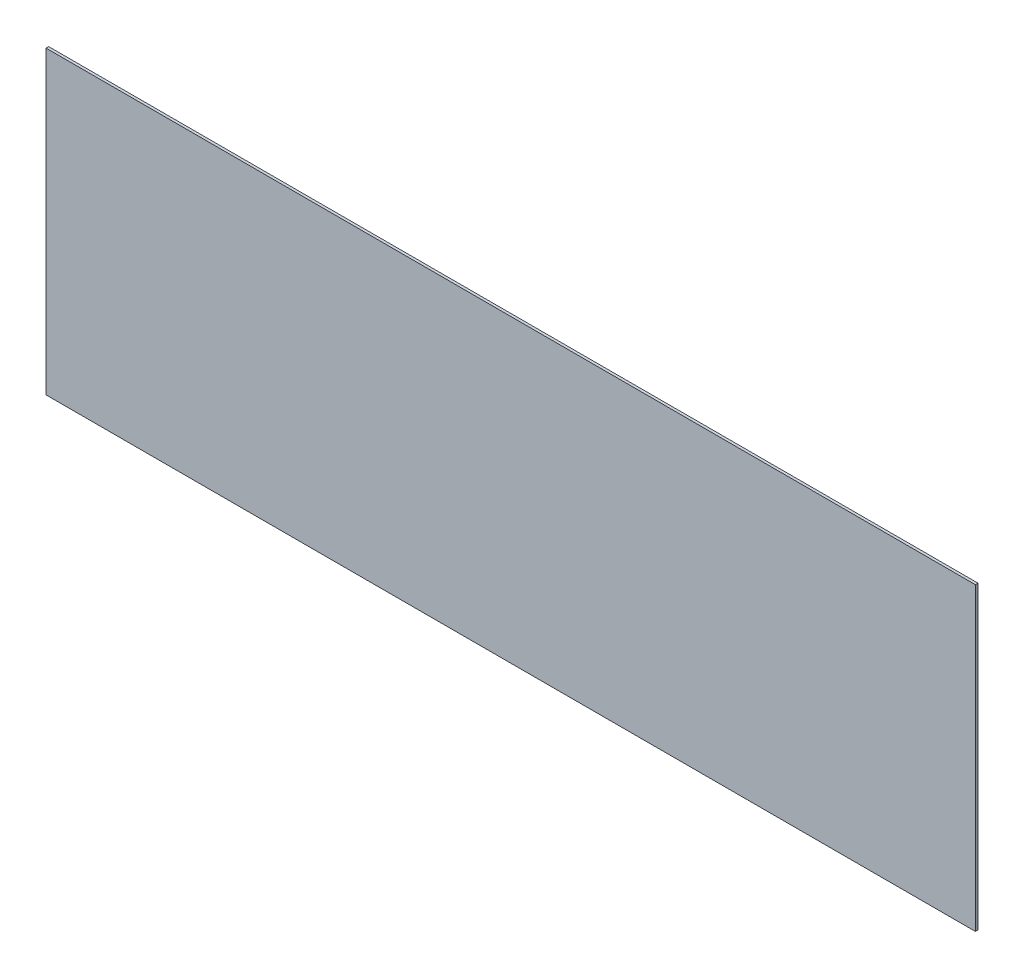
ISO-10303-21;
HEADER;
FILE_DESCRIPTION(('STEP AP214'),'2;1');
FILE_NAME('part.step','',(''),(''),'','','');
FILE_SCHEMA(('AUTOMOTIVE_DESIGN { 1 0 10303 214 1 1 1 1 }'));
ENDSEC;
DATA;
#1=APPLICATION_CONTEXT('core data for automotive mechanical design processes');
#2=APPLICATION_PROTOCOL_DEFINITION('international standard','automotive_design',2000,#1);
#3=PRODUCT_CONTEXT('',#1,'mechanical');
#4=PRODUCT('Part','Part','',(#3));
#5=PRODUCT_RELATED_PRODUCT_CATEGORY('part','',(#4));
#6=PRODUCT_DEFINITION_FORMATION('','',#4);
#7=PRODUCT_DEFINITION_CONTEXT('part definition',#1,'design');
#8=PRODUCT_DEFINITION('design','',#6,#7);
#9=PRODUCT_DEFINITION_SHAPE('','',#8);
#10=(LENGTH_UNIT() NAMED_UNIT(*) SI_UNIT(.MILLI.,.METRE.));
#11=(NAMED_UNIT(*) PLANE_ANGLE_UNIT() SI_UNIT($,.RADIAN.));
#12=(NAMED_UNIT(*) SI_UNIT($,.STERADIAN.) SOLID_ANGLE_UNIT());
#13=UNCERTAINTY_MEASURE_WITH_UNIT(LENGTH_MEASURE(1.E-05),#10,'distance_accuracy_value','');
#14=(GEOMETRIC_REPRESENTATION_CONTEXT(3) GLOBAL_UNCERTAINTY_ASSIGNED_CONTEXT((#13)) GLOBAL_UNIT_ASSIGNED_CONTEXT((#10,
#11,#12)) REPRESENTATION_CONTEXT('',''));
#15=CARTESIAN_POINT('',(0.,0.,0.));
#16=DIRECTION('',(0.,0.,1.));
#17=DIRECTION('',(1.,0.,0.));
#18=AXIS2_PLACEMENT_3D('',#15,#16,#17);
#19=CARTESIAN_POINT('',(61.722,-172.815354699861,0.126999999999988));
#20=DIRECTION('',(-1.,0.,0.));
#21=DIRECTION('',(0.,0.,1.));
#22=AXIS2_PLACEMENT_3D('',#19,#20,#21);
#23=PLANE('',#22);
#24=DIRECTION('',(0.,1.,0.));
#25=VECTOR('',#24,1.);
#26=CARTESIAN_POINT('',(61.722,-172.815354699861,0.));
#27=LINE('',#26,#25);
#28=CARTESIAN_POINT('',(61.722,-172.815354699861,0.));
#29=VERTEX_POINT('',#28);
#30=CARTESIAN_POINT('',(61.722,-158.369104699861,0.));
#31=VERTEX_POINT('',#30);
#32=EDGE_CURVE('E95',#29,#31,#27,.T.);
#33=ORIENTED_EDGE('',*,*,#32,.T.);
#34=DIRECTION('',(0.,0.,-1.));
#35=VECTOR('',#34,1.);
#36=CARTESIAN_POINT('',(61.722,-158.369104699861,0.126999999999988));
#37=LINE('',#36,#35);
#38=CARTESIAN_POINT('',(61.722,-158.369104699861,0.126999999999988));
#39=VERTEX_POINT('',#38);
#40=EDGE_CURVE('E11',#39,#31,#37,.T.);
#41=ORIENTED_EDGE('',*,*,#40,.F.);
#42=DIRECTION('',(0.,1.,0.));
#43=VECTOR('',#42,1.);
#44=CARTESIAN_POINT('',(61.722,-172.815354699861,0.126999999999988));
#45=LINE('',#44,#43);
#46=CARTESIAN_POINT('',(61.722,-172.815354699861,0.126999999999988));
#47=VERTEX_POINT('',#46);
#48=EDGE_CURVE('E83',#47,#39,#45,.T.);
#49=ORIENTED_EDGE('',*,*,#48,.F.);
#50=DIRECTION('',(0.,0.,-1.));
#51=VECTOR('',#50,1.);
#52=CARTESIAN_POINT('',(61.722,-172.815354699861,0.126999999999988));
#53=LINE('',#52,#51);
#54=EDGE_CURVE('E91',#47,#29,#53,.T.);
#55=ORIENTED_EDGE('',*,*,#54,.T.);
#56=EDGE_LOOP('',(#33,#41,#49,#55));
#57=FACE_BOUND('',#56,.T.);
#58=ADVANCED_FACE('F32',(#57),#23,.F.);
#59=CARTESIAN_POINT('',(61.722,-158.369104699861,0.126999999999988));
#60=DIRECTION('',(0.,-1.,0.));
#61=DIRECTION('',(0.,0.,-1.));
#62=AXIS2_PLACEMENT_3D('',#59,#60,#61);
#63=PLANE('',#62);
#64=DIRECTION('',(-1.,0.,0.));
#65=VECTOR('',#64,1.);
#66=CARTESIAN_POINT('',(61.722,-158.369104699861,0.));
#67=LINE('',#66,#65);
#68=CARTESIAN_POINT('',(17.018,-158.369104699861,0.));
#69=VERTEX_POINT('',#68);
#70=EDGE_CURVE('E87',#31,#69,#67,.T.);
#71=ORIENTED_EDGE('',*,*,#70,.T.);
#72=DIRECTION('',(0.,0.,-1.));
#73=VECTOR('',#72,1.);
#74=CARTESIAN_POINT('',(17.018,-158.369104699861,0.126999999999988));
#75=LINE('',#74,#73);
#76=CARTESIAN_POINT('',(17.018,-158.369104699861,0.126999999999988));
#77=VERTEX_POINT('',#76);
#78=EDGE_CURVE('E40',#77,#69,#75,.T.);
#79=ORIENTED_EDGE('',*,*,#78,.F.);
#80=DIRECTION('',(-1.,0.,0.));
#81=VECTOR('',#80,1.);
#82=CARTESIAN_POINT('',(61.722,-158.369104699861,0.126999999999988));
#83=LINE('',#82,#81);
#84=EDGE_CURVE('E78',#39,#77,#83,.T.);
#85=ORIENTED_EDGE('',*,*,#84,.F.);
#86=ORIENTED_EDGE('',*,*,#40,.T.);
#87=EDGE_LOOP('',(#71,#79,#85,#86));
#88=FACE_BOUND('',#87,.T.);
#89=ADVANCED_FACE('F86',(#88),#63,.F.);
#90=CARTESIAN_POINT('',(17.018,-172.815354699861,0.126999999999988));
#91=DIRECTION('',(1.,0.,0.));
#92=DIRECTION('',(0.,0.,-1.));
#93=AXIS2_PLACEMENT_3D('',#90,#91,#92);
#94=PLANE('',#93);
#95=DIRECTION('',(0.,-1.,0.));
#96=VECTOR('',#95,1.);
#97=CARTESIAN_POINT('',(17.018,-172.815354699861,0.));
#98=LINE('',#97,#96);
#99=CARTESIAN_POINT('',(17.018,-172.815354699861,0.));
#100=VERTEX_POINT('',#99);
#101=EDGE_CURVE('E65',#69,#100,#98,.T.);
#102=ORIENTED_EDGE('',*,*,#101,.T.);
#103=DIRECTION('',(0.,0.,-1.));
#104=VECTOR('',#103,1.);
#105=CARTESIAN_POINT('',(17.018,-172.815354699861,0.126999999999988));
#106=LINE('',#105,#104);
#107=CARTESIAN_POINT('',(17.018,-172.815354699861,0.126999999999988));
#108=VERTEX_POINT('',#107);
#109=EDGE_CURVE('E88',#108,#100,#106,.T.);
#110=ORIENTED_EDGE('',*,*,#109,.F.);
#111=DIRECTION('',(0.,-1.,0.));
#112=VECTOR('',#111,1.);
#113=CARTESIAN_POINT('',(17.018,-172.815354699861,0.126999999999988));
#114=LINE('',#113,#112);
#115=EDGE_CURVE('E81',#77,#108,#114,.T.);
#116=ORIENTED_EDGE('',*,*,#115,.F.);
#117=ORIENTED_EDGE('',*,*,#78,.T.);
#118=EDGE_LOOP('',(#102,#110,#116,#117));
#119=FACE_BOUND('',#118,.T.);
#120=ADVANCED_FACE('F89',(#119),#94,.F.);
#121=CARTESIAN_POINT('',(61.722,-172.815354699861,0.126999999999988));
#122=DIRECTION('',(0.,1.,0.));
#123=DIRECTION('',(0.,0.,1.));
#124=AXIS2_PLACEMENT_3D('',#121,#122,#123);
#125=PLANE('',#124);
#126=DIRECTION('',(1.,0.,0.));
#127=VECTOR('',#126,1.);
#128=CARTESIAN_POINT('',(61.722,-172.815354699861,0.));
#129=LINE('',#128,#127);
#130=EDGE_CURVE('E71',#100,#29,#129,.T.);
#131=ORIENTED_EDGE('',*,*,#130,.T.);
#132=ORIENTED_EDGE('',*,*,#54,.F.);
#133=DIRECTION('',(1.,0.,0.));
#134=VECTOR('',#133,1.);
#135=CARTESIAN_POINT('',(61.722,-172.815354699861,0.126999999999988));
#136=LINE('',#135,#134);
#137=EDGE_CURVE('E48',#108,#47,#136,.T.);
#138=ORIENTED_EDGE('',*,*,#137,.F.);
#139=ORIENTED_EDGE('',*,*,#109,.T.);
#140=EDGE_LOOP('',(#131,#132,#138,#139));
#141=FACE_BOUND('',#140,.T.);
#142=ADVANCED_FACE('F102',(#141),#125,.F.);
#143=CARTESIAN_POINT('',(0.,0.,0.126999999999988));
#144=DIRECTION('',(0.,0.,1.));
#145=DIRECTION('',(1.,0.,0.));
#146=AXIS2_PLACEMENT_3D('',#143,#144,#145);
#147=PLANE('',#146);
#148=ORIENTED_EDGE('',*,*,#48,.T.);
#149=ORIENTED_EDGE('',*,*,#84,.T.);
#150=ORIENTED_EDGE('',*,*,#115,.T.);
#151=ORIENTED_EDGE('',*,*,#137,.T.);
#152=EDGE_LOOP('',(#148,#149,#150,#151));
#153=FACE_BOUND('',#152,.T.);
#154=ADVANCED_FACE('F79',(#153),#147,.T.);
#155=CARTESIAN_POINT('',(0.,0.,0.));
#156=DIRECTION('',(0.,0.,1.));
#157=DIRECTION('',(1.,0.,0.));
#158=AXIS2_PLACEMENT_3D('',#155,#156,#157);
#159=PLANE('',#158);
#160=ORIENTED_EDGE('',*,*,#32,.F.);
#161=ORIENTED_EDGE('',*,*,#130,.F.);
#162=ORIENTED_EDGE('',*,*,#101,.F.);
#163=ORIENTED_EDGE('',*,*,#70,.F.);
#164=EDGE_LOOP('',(#160,#161,#162,#163));
#165=FACE_BOUND('',#164,.T.);
#166=ADVANCED_FACE('F105',(#165),#159,.F.);
#167=CLOSED_SHELL('',(#58,#89,#120,#142,#154,#166));
#168=MANIFOLD_SOLID_BREP('B2',#167);
#169=ADVANCED_BREP_SHAPE_REPRESENTATION('',(#18,#168),#14);
#170=SHAPE_DEFINITION_REPRESENTATION(#9,#169);
ENDSEC;
END-ISO-10303-21;
